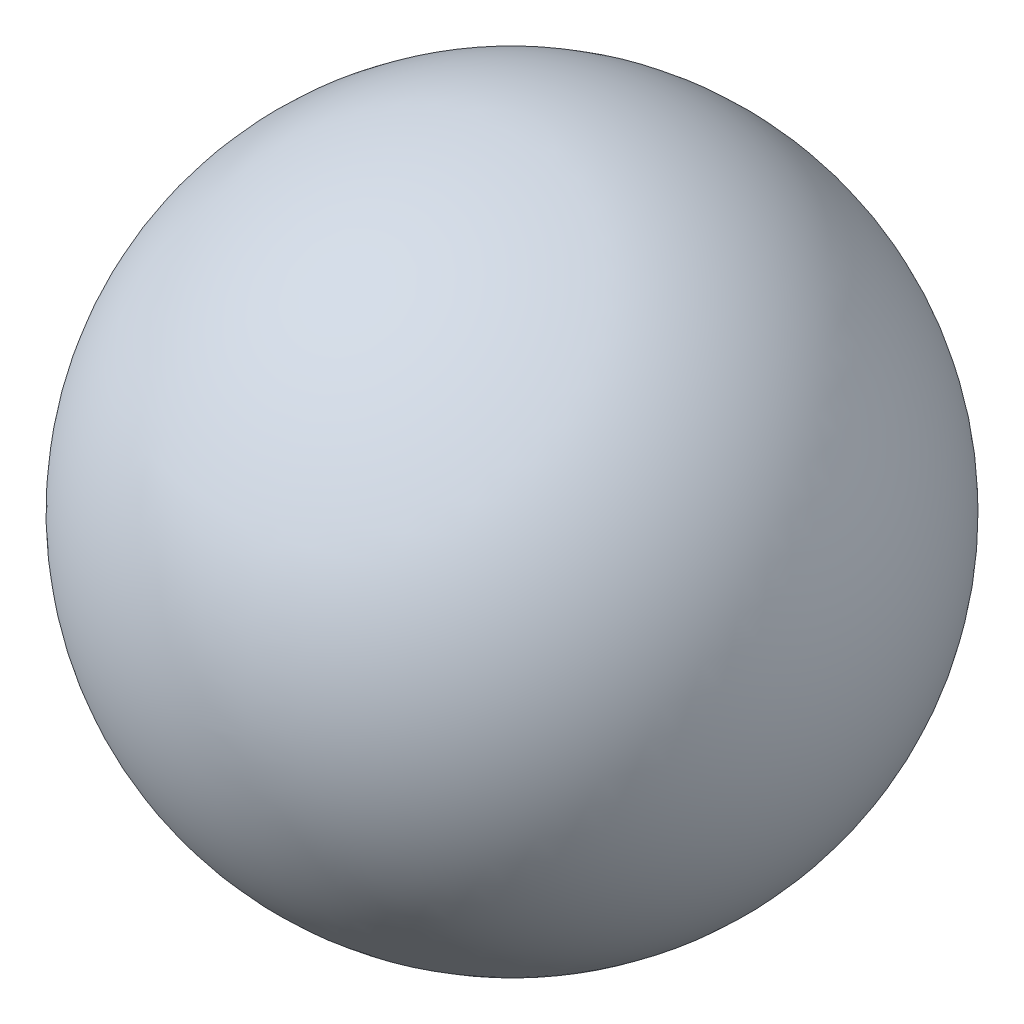
ISO-10303-21;
HEADER;
FILE_DESCRIPTION(('STEP AP214'),'2;1');
FILE_NAME('part.step','',(''),(''),'','','');
FILE_SCHEMA(('AUTOMOTIVE_DESIGN { 1 0 10303 214 1 1 1 1 }'));
ENDSEC;
DATA;
#1=APPLICATION_CONTEXT('core data for automotive mechanical design processes');
#2=APPLICATION_PROTOCOL_DEFINITION('international standard','automotive_design',2000,#1);
#3=PRODUCT_CONTEXT('',#1,'mechanical');
#4=PRODUCT('Part','Part','',(#3));
#5=PRODUCT_RELATED_PRODUCT_CATEGORY('part','',(#4));
#6=PRODUCT_DEFINITION_FORMATION('','',#4);
#7=PRODUCT_DEFINITION_CONTEXT('part definition',#1,'design');
#8=PRODUCT_DEFINITION('design','',#6,#7);
#9=PRODUCT_DEFINITION_SHAPE('','',#8);
#10=(LENGTH_UNIT() NAMED_UNIT(*) SI_UNIT(.MILLI.,.METRE.));
#11=(NAMED_UNIT(*) PLANE_ANGLE_UNIT() SI_UNIT($,.RADIAN.));
#12=(NAMED_UNIT(*) SI_UNIT($,.STERADIAN.) SOLID_ANGLE_UNIT());
#13=UNCERTAINTY_MEASURE_WITH_UNIT(LENGTH_MEASURE(1.E-05),#10,'distance_accuracy_value','');
#14=(GEOMETRIC_REPRESENTATION_CONTEXT(3) GLOBAL_UNCERTAINTY_ASSIGNED_CONTEXT((#13)) GLOBAL_UNIT_ASSIGNED_CONTEXT((#10,
#11,#12)) REPRESENTATION_CONTEXT('',''));
#15=CARTESIAN_POINT('',(0.,0.,0.));
#16=DIRECTION('',(0.,0.,1.));
#17=DIRECTION('',(1.,0.,0.));
#18=AXIS2_PLACEMENT_3D('',#15,#16,#17);
#19=CARTESIAN_POINT('',(67.76,69.1419027745493,5.33601320882626));
#20=DIRECTION('',(0.,0.997035261178115,0.0769460068326364));
#21=DIRECTION('',(0.173648177666934,-0.0757770240921106,0.981888055234759));
#22=AXIS2_PLACEMENT_3D('',#19,#20,#21);
#23=SPHERICAL_SURFACE('',#22,7.15);
#24=CARTESIAN_POINT('',(67.76,62.0131006571258,4.78584925997291));
#25=VERTEX_POINT('',#24);
#26=VERTEX_LOOP('',#25);
#27=FACE_BOUND('',#26,.T.);
#28=CARTESIAN_POINT('',(67.76,76.2707048919728,5.8861771576796));
#29=VERTEX_POINT('',#28);
#30=VERTEX_LOOP('',#29);
#31=FACE_BOUND('',#30,.T.);
#32=ADVANCED_FACE('F16',(#27,#31),#23,.T.);
#33=CLOSED_SHELL('',(#32));
#34=MANIFOLD_SOLID_BREP('B1',#33);
#35=ADVANCED_BREP_SHAPE_REPRESENTATION('',(#18,#34),#14);
#36=SHAPE_DEFINITION_REPRESENTATION(#9,#35);
ENDSEC;
END-ISO-10303-21;
